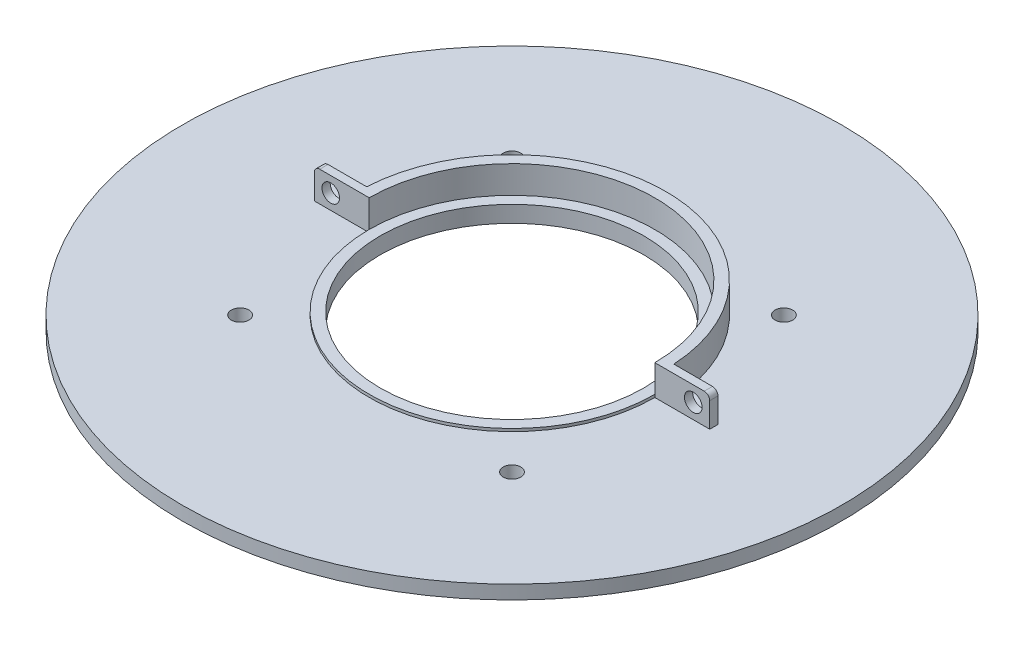
ISO-10303-21;
HEADER;
FILE_DESCRIPTION(('STEP AP214'),'2;1');
FILE_NAME('part.step','',(''),(''),'','','');
FILE_SCHEMA(('AUTOMOTIVE_DESIGN { 1 0 10303 214 1 1 1 1 }'));
ENDSEC;
DATA;
#1=APPLICATION_CONTEXT('core data for automotive mechanical design processes');
#2=APPLICATION_PROTOCOL_DEFINITION('international standard','automotive_design',2000,#1);
#3=PRODUCT_CONTEXT('',#1,'mechanical');
#4=PRODUCT('Part','Part','',(#3));
#5=PRODUCT_RELATED_PRODUCT_CATEGORY('part','',(#4));
#6=PRODUCT_DEFINITION_FORMATION('','',#4);
#7=PRODUCT_DEFINITION_CONTEXT('part definition',#1,'design');
#8=PRODUCT_DEFINITION('design','',#6,#7);
#9=PRODUCT_DEFINITION_SHAPE('','',#8);
#10=(LENGTH_UNIT() NAMED_UNIT(*) SI_UNIT(.MILLI.,.METRE.));
#11=(NAMED_UNIT(*) PLANE_ANGLE_UNIT() SI_UNIT($,.RADIAN.));
#12=(NAMED_UNIT(*) SI_UNIT($,.STERADIAN.) SOLID_ANGLE_UNIT());
#13=UNCERTAINTY_MEASURE_WITH_UNIT(LENGTH_MEASURE(1.E-05),#10,'distance_accuracy_value','');
#14=(GEOMETRIC_REPRESENTATION_CONTEXT(3) GLOBAL_UNCERTAINTY_ASSIGNED_CONTEXT((#13)) GLOBAL_UNIT_ASSIGNED_CONTEXT((#10,
#11,#12)) REPRESENTATION_CONTEXT('',''));
#15=CARTESIAN_POINT('',(0.,0.,0.));
#16=DIRECTION('',(0.,0.,1.));
#17=DIRECTION('',(1.,0.,0.));
#18=AXIS2_PLACEMENT_3D('',#15,#16,#17);
#19=CARTESIAN_POINT('',(0.,3.,0.));
#20=DIRECTION('',(0.,1.,0.));
#21=DIRECTION('',(0.,0.,1.));
#22=AXIS2_PLACEMENT_3D('',#19,#20,#21);
#23=CYLINDRICAL_SURFACE('',#22,28.);
#24=CARTESIAN_POINT('',(0.,4.5,0.));
#25=DIRECTION('',(0.,-1.,0.));
#26=DIRECTION('',(0.,0.,-1.));
#27=AXIS2_PLACEMENT_3D('',#24,#25,#26);
#28=CIRCLE('',#27,28.);
#29=CARTESIAN_POINT('',(27.9597925600316,4.5,-1.5));
#30=VERTEX_POINT('',#29);
#31=CARTESIAN_POINT('',(-27.9597925600316,4.5,-1.5));
#32=VERTEX_POINT('',#31);
#33=EDGE_CURVE('E156',#30,#32,#28,.F.);
#34=ORIENTED_EDGE('',*,*,#33,.T.);
#35=DIRECTION('',(0.,1.,0.));
#36=VECTOR('',#35,1.);
#37=CARTESIAN_POINT('',(-27.9597925600316,4.00000000000001,-1.5));
#38=LINE('',#37,#36);
#39=CARTESIAN_POINT('',(-27.9597925600316,10.,-1.5));
#40=VERTEX_POINT('',#39);
#41=EDGE_CURVE('E200',#32,#40,#38,.T.);
#42=ORIENTED_EDGE('',*,*,#41,.T.);
#43=CARTESIAN_POINT('',(0.,10.,0.));
#44=DIRECTION('',(0.,1.,0.));
#45=DIRECTION('',(0.,0.,1.));
#46=AXIS2_PLACEMENT_3D('',#43,#44,#45);
#47=CIRCLE('',#46,28.);
#48=CARTESIAN_POINT('',(27.9597925600316,10.,-1.5));
#49=VERTEX_POINT('',#48);
#50=EDGE_CURVE('E184',#49,#40,#47,.T.);
#51=ORIENTED_EDGE('',*,*,#50,.F.);
#52=DIRECTION('',(0.,1.,0.));
#53=VECTOR('',#52,1.);
#54=CARTESIAN_POINT('',(27.9597925600316,4.00000000000001,-1.5));
#55=LINE('',#54,#53);
#56=EDGE_CURVE('E203',#30,#49,#55,.T.);
#57=ORIENTED_EDGE('',*,*,#56,.F.);
#58=EDGE_LOOP('',(#34,#42,#51,#57));
#59=FACE_BOUND('',#58,.T.);
#60=ADVANCED_FACE('F61',(#59),#23,.T.);
#61=CARTESIAN_POINT('',(-39.5,5.,-29.6));
#62=DIRECTION('',(0.,1.,0.));
#63=DIRECTION('',(0.,0.,1.));
#64=AXIS2_PLACEMENT_3D('',#61,#62,#63);
#65=PLANE('',#64);
#66=CARTESIAN_POINT('',(0.,5.,0.));
#67=DIRECTION('',(0.,1.,0.));
#68=DIRECTION('',(0.,0.,1.));
#69=AXIS2_PLACEMENT_3D('',#66,#67,#68);
#70=CIRCLE('',#69,24.);
#71=CARTESIAN_POINT('',(0.,5.,24.));
#72=VERTEX_POINT('',#71);
#73=EDGE_CURVE('E242',#72,#72,#70,.T.);
#74=ORIENTED_EDGE('',*,*,#73,.F.);
#75=EDGE_LOOP('',(#74));
#76=FACE_BOUND('',#75,.T.);
#77=CARTESIAN_POINT('',(0.,5.,0.));
#78=DIRECTION('',(0.,-1.,0.));
#79=DIRECTION('',(0.,0.,1.));
#80=AXIS2_PLACEMENT_3D('',#77,#78,#79);
#81=CIRCLE('',#80,26.);
#82=CARTESIAN_POINT('',(26.,5.,0.));
#83=VERTEX_POINT('',#82);
#84=CARTESIAN_POINT('',(-26.,5.,0.));
#85=VERTEX_POINT('',#84);
#86=EDGE_CURVE('E170',#83,#85,#81,.T.);
#87=ORIENTED_EDGE('',*,*,#86,.F.);
#88=CARTESIAN_POINT('',(0.,5.,0.));
#89=DIRECTION('',(0.,1.,0.));
#90=DIRECTION('',(0.,0.,1.));
#91=AXIS2_PLACEMENT_3D('',#88,#89,#90);
#92=CIRCLE('',#91,26.);
#93=EDGE_CURVE('E222',#83,#85,#92,.T.);
#94=ORIENTED_EDGE('',*,*,#93,.T.);
#95=EDGE_LOOP('',(#87,#94));
#96=FACE_BOUND('',#95,.T.);
#97=ADVANCED_FACE('F308',(#76,#96),#65,.T.);
#98=CARTESIAN_POINT('',(0.,4.5,0.));
#99=DIRECTION('',(0.,-1.,0.));
#100=DIRECTION('',(0.,0.,-1.));
#101=AXIS2_PLACEMENT_3D('',#98,#99,#100);
#102=PLANE('',#101);
#103=CARTESIAN_POINT('',(24.7487373415292,4.5,24.7487373415292));
#104=DIRECTION('',(0.,-1.,0.));
#105=DIRECTION('',(0.,0.,-1.));
#106=AXIS2_PLACEMENT_3D('',#103,#104,#105);
#107=CIRCLE('',#106,1.6);
#108=CARTESIAN_POINT('',(24.7487373415292,4.5,23.1487373415292));
#109=VERTEX_POINT('',#108);
#110=EDGE_CURVE('E65',#109,#109,#107,.T.);
#111=ORIENTED_EDGE('',*,*,#110,.T.);
#112=EDGE_LOOP('',(#111));
#113=FACE_BOUND('',#112,.T.);
#114=CARTESIAN_POINT('',(24.7487373415292,4.5,-24.7487373415292));
#115=DIRECTION('',(0.,-1.,0.));
#116=DIRECTION('',(0.,0.,-1.));
#117=AXIS2_PLACEMENT_3D('',#114,#115,#116);
#118=CIRCLE('',#117,1.6);
#119=CARTESIAN_POINT('',(24.7487373415292,4.5,-26.3487373415292));
#120=VERTEX_POINT('',#119);
#121=EDGE_CURVE('E245',#120,#120,#118,.T.);
#122=ORIENTED_EDGE('',*,*,#121,.T.);
#123=EDGE_LOOP('',(#122));
#124=FACE_BOUND('',#123,.T.);
#125=CARTESIAN_POINT('',(-24.7487373415292,4.5,-24.7487373415292));
#126=DIRECTION('',(0.,-1.,0.));
#127=DIRECTION('',(0.,0.,-1.));
#128=AXIS2_PLACEMENT_3D('',#125,#126,#127);
#129=CIRCLE('',#128,1.6);
#130=CARTESIAN_POINT('',(-24.7487373415292,4.5,-26.3487373415292));
#131=VERTEX_POINT('',#130);
#132=EDGE_CURVE('E243',#131,#131,#129,.T.);
#133=ORIENTED_EDGE('',*,*,#132,.T.);
#134=EDGE_LOOP('',(#133));
#135=FACE_BOUND('',#134,.T.);
#136=CARTESIAN_POINT('',(-24.7487373415292,4.5,24.7487373415292));
#137=DIRECTION('',(0.,-1.,0.));
#138=DIRECTION('',(0.,0.,-1.));
#139=AXIS2_PLACEMENT_3D('',#136,#137,#138);
#140=CIRCLE('',#139,1.6);
#141=CARTESIAN_POINT('',(-24.7487373415292,4.5,23.1487373415292));
#142=VERTEX_POINT('',#141);
#143=EDGE_CURVE('E239',#142,#142,#140,.T.);
#144=ORIENTED_EDGE('',*,*,#143,.T.);
#145=EDGE_LOOP('',(#144));
#146=FACE_BOUND('',#145,.T.);
#147=DIRECTION('',(-1.,0.,0.));
#148=VECTOR('',#147,1.);
#149=CARTESIAN_POINT('',(0.,4.5,0.));
#150=LINE('',#149,#148);
#151=CARTESIAN_POINT('',(36.,4.5,0.));
#152=VERTEX_POINT('',#151);
#153=CARTESIAN_POINT('',(26.,4.5,0.));
#154=VERTEX_POINT('',#153);
#155=EDGE_CURVE('E146',#152,#154,#150,.T.);
#156=ORIENTED_EDGE('',*,*,#155,.T.);
#157=CARTESIAN_POINT('',(0.,4.5,0.));
#158=DIRECTION('',(0.,-1.,0.));
#159=DIRECTION('',(0.,0.,-1.));
#160=AXIS2_PLACEMENT_3D('',#157,#158,#159);
#161=CIRCLE('',#160,26.);
#162=CARTESIAN_POINT('',(-26.,4.5,0.));
#163=VERTEX_POINT('',#162);
#164=EDGE_CURVE('E151',#154,#163,#161,.T.);
#165=ORIENTED_EDGE('',*,*,#164,.T.);
#166=DIRECTION('',(-1.,0.,0.));
#167=VECTOR('',#166,1.);
#168=CARTESIAN_POINT('',(0.,4.5,0.));
#169=LINE('',#168,#167);
#170=CARTESIAN_POINT('',(-36.,4.5,0.));
#171=VERTEX_POINT('',#170);
#172=EDGE_CURVE('E220',#163,#171,#169,.T.);
#173=ORIENTED_EDGE('',*,*,#172,.T.);
#174=DIRECTION('',(0.,0.,1.));
#175=VECTOR('',#174,1.);
#176=CARTESIAN_POINT('',(-36.,4.5,0.));
#177=LINE('',#176,#175);
#178=CARTESIAN_POINT('',(-36.,4.5,-1.5));
#179=VERTEX_POINT('',#178);
#180=EDGE_CURVE('E218',#179,#171,#177,.T.);
#181=ORIENTED_EDGE('',*,*,#180,.F.);
#182=DIRECTION('',(-1.,0.,0.));
#183=VECTOR('',#182,1.);
#184=CARTESIAN_POINT('',(0.,4.5,-1.5));
#185=LINE('',#184,#183);
#186=EDGE_CURVE('E216',#32,#179,#185,.T.);
#187=ORIENTED_EDGE('',*,*,#186,.F.);
#188=ORIENTED_EDGE('',*,*,#33,.F.);
#189=DIRECTION('',(1.,0.,0.));
#190=VECTOR('',#189,1.);
#191=CARTESIAN_POINT('',(0.,4.5,-1.5));
#192=LINE('',#191,#190);
#193=CARTESIAN_POINT('',(36.,4.5,-1.5));
#194=VERTEX_POINT('',#193);
#195=EDGE_CURVE('E214',#30,#194,#192,.T.);
#196=ORIENTED_EDGE('',*,*,#195,.T.);
#197=DIRECTION('',(0.,0.,1.));
#198=VECTOR('',#197,1.);
#199=CARTESIAN_POINT('',(36.,4.5,0.));
#200=LINE('',#199,#198);
#201=EDGE_CURVE('E153',#194,#152,#200,.T.);
#202=ORIENTED_EDGE('',*,*,#201,.T.);
#203=EDGE_LOOP('',(#156,#165,#173,#181,#187,#188,#196,#202));
#204=FACE_BOUND('',#203,.T.);
#205=CARTESIAN_POINT('',(0.,4.5,0.));
#206=DIRECTION('',(0.,-1.,0.));
#207=DIRECTION('',(0.,0.,-1.));
#208=AXIS2_PLACEMENT_3D('',#205,#206,#207);
#209=CIRCLE('',#208,60.);
#210=CARTESIAN_POINT('',(0.,4.50000000000003,-60.));
#211=VERTEX_POINT('',#210);
#212=EDGE_CURVE('E513',#211,#211,#209,.F.);
#213=ORIENTED_EDGE('',*,*,#212,.T.);
#214=EDGE_LOOP('',(#213));
#215=FACE_BOUND('',#214,.T.);
#216=ADVANCED_FACE('F148',(#113,#124,#135,#146,#204,#215),#102,.F.);
#217=CARTESIAN_POINT('',(-36.,4.00000000000001,0.));
#218=DIRECTION('',(1.,0.,0.));
#219=DIRECTION('',(0.,0.,-1.));
#220=AXIS2_PLACEMENT_3D('',#217,#218,#219);
#221=PLANE('',#220);
#222=DIRECTION('',(0.,1.,0.));
#223=VECTOR('',#222,1.);
#224=CARTESIAN_POINT('',(-36.,4.00000000000001,0.));
#225=LINE('',#224,#223);
#226=CARTESIAN_POINT('',(-36.,9.,0.));
#227=VERTEX_POINT('',#226);
#228=EDGE_CURVE('E194',#171,#227,#225,.T.);
#229=ORIENTED_EDGE('',*,*,#228,.T.);
#230=DIRECTION('',(0.,0.,-1.));
#231=VECTOR('',#230,1.);
#232=CARTESIAN_POINT('',(-36.,9.,-1.5));
#233=LINE('',#232,#231);
#234=CARTESIAN_POINT('',(-36.,9.,-1.5));
#235=VERTEX_POINT('',#234);
#236=EDGE_CURVE('E225',#227,#235,#233,.T.);
#237=ORIENTED_EDGE('',*,*,#236,.T.);
#238=DIRECTION('',(0.,1.,0.));
#239=VECTOR('',#238,1.);
#240=CARTESIAN_POINT('',(-36.,4.00000000000001,-1.5));
#241=LINE('',#240,#239);
#242=EDGE_CURVE('E197',#179,#235,#241,.T.);
#243=ORIENTED_EDGE('',*,*,#242,.F.);
#244=ORIENTED_EDGE('',*,*,#180,.T.);
#245=EDGE_LOOP('',(#229,#237,#243,#244));
#246=FACE_BOUND('',#245,.T.);
#247=ADVANCED_FACE('F333',(#246),#221,.F.);
#248=CARTESIAN_POINT('',(0.,4.00000000000001,-1.5));
#249=DIRECTION('',(0.,0.,1.));
#250=DIRECTION('',(1.,0.,0.));
#251=AXIS2_PLACEMENT_3D('',#248,#249,#250);
#252=PLANE('',#251);
#253=CARTESIAN_POINT('',(-33.,7.25,-1.5));
#254=DIRECTION('',(0.,0.,1.));
#255=DIRECTION('',(1.,0.,0.));
#256=AXIS2_PLACEMENT_3D('',#253,#254,#255);
#257=CIRCLE('',#256,1.6);
#258=CARTESIAN_POINT('',(-31.4,7.25,-1.5));
#259=VERTEX_POINT('',#258);
#260=EDGE_CURVE('E172',#259,#259,#257,.T.);
#261=ORIENTED_EDGE('',*,*,#260,.T.);
#262=EDGE_LOOP('',(#261));
#263=FACE_BOUND('',#262,.T.);
#264=ORIENTED_EDGE('',*,*,#242,.T.);
#265=CARTESIAN_POINT('',(-35.,9.,-1.5));
#266=DIRECTION('',(0.,0.,1.));
#267=DIRECTION('',(1.,0.,0.));
#268=AXIS2_PLACEMENT_3D('',#265,#266,#267);
#269=CIRCLE('',#268,1.);
#270=CARTESIAN_POINT('',(-35.,10.,-1.5));
#271=VERTEX_POINT('',#270);
#272=EDGE_CURVE('E228',#235,#271,#269,.F.);
#273=ORIENTED_EDGE('',*,*,#272,.T.);
#274=DIRECTION('',(1.,0.,0.));
#275=VECTOR('',#274,1.);
#276=CARTESIAN_POINT('',(0.,10.,-1.5));
#277=LINE('',#276,#275);
#278=EDGE_CURVE('E187',#271,#40,#277,.T.);
#279=ORIENTED_EDGE('',*,*,#278,.T.);
#280=ORIENTED_EDGE('',*,*,#41,.F.);
#281=ORIENTED_EDGE('',*,*,#186,.T.);
#282=EDGE_LOOP('',(#264,#273,#279,#280,#281));
#283=FACE_BOUND('',#282,.T.);
#284=ADVANCED_FACE('F290',(#263,#283),#252,.F.);
#285=CARTESIAN_POINT('',(0.,4.00000000000001,-1.5));
#286=DIRECTION('',(0.,0.,-1.));
#287=DIRECTION('',(-1.,0.,0.));
#288=AXIS2_PLACEMENT_3D('',#285,#286,#287);
#289=PLANE('',#288);
#290=CARTESIAN_POINT('',(33.,7.25,-1.5));
#291=DIRECTION('',(0.,0.,-1.));
#292=DIRECTION('',(-1.,0.,0.));
#293=AXIS2_PLACEMENT_3D('',#290,#291,#292);
#294=CIRCLE('',#293,1.6);
#295=CARTESIAN_POINT('',(31.4,7.25,-1.5));
#296=VERTEX_POINT('',#295);
#297=EDGE_CURVE('E281',#296,#296,#294,.T.);
#298=ORIENTED_EDGE('',*,*,#297,.F.);
#299=EDGE_LOOP('',(#298));
#300=FACE_BOUND('',#299,.T.);
#301=DIRECTION('',(-1.,0.,0.));
#302=VECTOR('',#301,1.);
#303=CARTESIAN_POINT('',(0.,10.,-1.5));
#304=LINE('',#303,#302);
#305=CARTESIAN_POINT('',(35.,10.,-1.5));
#306=VERTEX_POINT('',#305);
#307=EDGE_CURVE('E182',#306,#49,#304,.T.);
#308=ORIENTED_EDGE('',*,*,#307,.F.);
#309=CARTESIAN_POINT('',(35.,9.,-1.5));
#310=DIRECTION('',(0.,0.,-1.));
#311=DIRECTION('',(-1.,0.,0.));
#312=AXIS2_PLACEMENT_3D('',#309,#310,#311);
#313=CIRCLE('',#312,1.);
#314=CARTESIAN_POINT('',(36.,9.,-1.5));
#315=VERTEX_POINT('',#314);
#316=EDGE_CURVE('E85',#306,#315,#313,.T.);
#317=ORIENTED_EDGE('',*,*,#316,.T.);
#318=DIRECTION('',(0.,1.,0.));
#319=VECTOR('',#318,1.);
#320=CARTESIAN_POINT('',(36.,4.00000000000001,-1.5));
#321=LINE('',#320,#319);
#322=EDGE_CURVE('E206',#194,#315,#321,.T.);
#323=ORIENTED_EDGE('',*,*,#322,.F.);
#324=ORIENTED_EDGE('',*,*,#195,.F.);
#325=ORIENTED_EDGE('',*,*,#56,.T.);
#326=EDGE_LOOP('',(#308,#317,#323,#324,#325));
#327=FACE_BOUND('',#326,.T.);
#328=ADVANCED_FACE('F349',(#300,#327),#289,.T.);
#329=CARTESIAN_POINT('',(36.,4.00000000000001,0.));
#330=DIRECTION('',(1.,0.,0.));
#331=DIRECTION('',(0.,0.,-1.));
#332=AXIS2_PLACEMENT_3D('',#329,#330,#331);
#333=PLANE('',#332);
#334=ORIENTED_EDGE('',*,*,#322,.T.);
#335=DIRECTION('',(0.,0.,-1.));
#336=VECTOR('',#335,1.);
#337=CARTESIAN_POINT('',(36.,9.,0.));
#338=LINE('',#337,#336);
#339=CARTESIAN_POINT('',(36.,9.,0.));
#340=VERTEX_POINT('',#339);
#341=EDGE_CURVE('E70',#315,#340,#338,.F.);
#342=ORIENTED_EDGE('',*,*,#341,.T.);
#343=DIRECTION('',(0.,1.,0.));
#344=VECTOR('',#343,1.);
#345=CARTESIAN_POINT('',(36.,4.00000000000001,0.));
#346=LINE('',#345,#344);
#347=EDGE_CURVE('E208',#152,#340,#346,.T.);
#348=ORIENTED_EDGE('',*,*,#347,.F.);
#349=ORIENTED_EDGE('',*,*,#201,.F.);
#350=EDGE_LOOP('',(#334,#342,#348,#349));
#351=FACE_BOUND('',#350,.T.);
#352=ADVANCED_FACE('F350',(#351),#333,.T.);
#353=CARTESIAN_POINT('',(0.,4.00000000000001,0.));
#354=DIRECTION('',(0.,1.,0.));
#355=DIRECTION('',(0.,0.,1.));
#356=AXIS2_PLACEMENT_3D('',#353,#354,#355);
#357=CYLINDRICAL_SURFACE('',#356,26.);
#358=ORIENTED_EDGE('',*,*,#93,.F.);
#359=DIRECTION('',(0.,1.,0.));
#360=VECTOR('',#359,1.);
#361=CARTESIAN_POINT('',(26.,4.00000000000001,0.));
#362=LINE('',#361,#360);
#363=CARTESIAN_POINT('',(26.,10.,0.));
#364=VERTEX_POINT('',#363);
#365=EDGE_CURVE('E169',#83,#364,#362,.T.);
#366=ORIENTED_EDGE('',*,*,#365,.T.);
#367=CARTESIAN_POINT('',(0.,10.,0.));
#368=DIRECTION('',(0.,1.,0.));
#369=DIRECTION('',(0.,0.,1.));
#370=AXIS2_PLACEMENT_3D('',#367,#368,#369);
#371=CIRCLE('',#370,26.);
#372=CARTESIAN_POINT('',(-26.,10.,0.));
#373=VERTEX_POINT('',#372);
#374=EDGE_CURVE('E176',#364,#373,#371,.T.);
#375=ORIENTED_EDGE('',*,*,#374,.T.);
#376=DIRECTION('',(0.,1.,0.));
#377=VECTOR('',#376,1.);
#378=CARTESIAN_POINT('',(-26.,4.00000000000001,0.));
#379=LINE('',#378,#377);
#380=EDGE_CURVE('E191',#85,#373,#379,.T.);
#381=ORIENTED_EDGE('',*,*,#380,.F.);
#382=EDGE_LOOP('',(#358,#366,#375,#381));
#383=FACE_BOUND('',#382,.T.);
#384=ADVANCED_FACE('F342',(#383),#357,.F.);
#385=CARTESIAN_POINT('',(0.,4.00000000000001,0.));
#386=DIRECTION('',(0.,0.,1.));
#387=DIRECTION('',(1.,0.,0.));
#388=AXIS2_PLACEMENT_3D('',#385,#386,#387);
#389=PLANE('',#388);
#390=CARTESIAN_POINT('',(-33.,7.25,0.));
#391=DIRECTION('',(0.,0.,1.));
#392=DIRECTION('',(1.,0.,0.));
#393=AXIS2_PLACEMENT_3D('',#390,#391,#392);
#394=CIRCLE('',#393,1.6);
#395=CARTESIAN_POINT('',(-31.4,7.25,0.));
#396=VERTEX_POINT('',#395);
#397=EDGE_CURVE('E284',#396,#396,#394,.T.);
#398=ORIENTED_EDGE('',*,*,#397,.F.);
#399=EDGE_LOOP('',(#398));
#400=FACE_BOUND('',#399,.T.);
#401=DIRECTION('',(1.,0.,0.));
#402=VECTOR('',#401,1.);
#403=CARTESIAN_POINT('',(0.,10.,0.));
#404=LINE('',#403,#402);
#405=CARTESIAN_POINT('',(-35.,10.,0.));
#406=VERTEX_POINT('',#405);
#407=EDGE_CURVE('E189',#406,#373,#404,.T.);
#408=ORIENTED_EDGE('',*,*,#407,.F.);
#409=CARTESIAN_POINT('',(-35.,9.,0.));
#410=DIRECTION('',(0.,0.,1.));
#411=DIRECTION('',(1.,0.,0.));
#412=AXIS2_PLACEMENT_3D('',#409,#410,#411);
#413=CIRCLE('',#412,1.);
#414=EDGE_CURVE('E235',#406,#227,#413,.T.);
#415=ORIENTED_EDGE('',*,*,#414,.T.);
#416=ORIENTED_EDGE('',*,*,#228,.F.);
#417=ORIENTED_EDGE('',*,*,#172,.F.);
#418=DIRECTION('',(0.,1.,0.));
#419=VECTOR('',#418,1.);
#420=CARTESIAN_POINT('',(-26.,-58.1099033699941,0.));
#421=LINE('',#420,#419);
#422=EDGE_CURVE('E164',#163,#85,#421,.T.);
#423=ORIENTED_EDGE('',*,*,#422,.T.);
#424=ORIENTED_EDGE('',*,*,#380,.T.);
#425=EDGE_LOOP('',(#408,#415,#416,#417,#423,#424));
#426=FACE_BOUND('',#425,.T.);
#427=ADVANCED_FACE('F331',(#400,#426),#389,.T.);
#428=CARTESIAN_POINT('',(0.,4.00000000000001,0.));
#429=DIRECTION('',(0.,0.,1.));
#430=DIRECTION('',(1.,0.,0.));
#431=AXIS2_PLACEMENT_3D('',#428,#429,#430);
#432=PLANE('',#431);
#433=CARTESIAN_POINT('',(33.,7.25,0.));
#434=DIRECTION('',(0.,0.,1.));
#435=DIRECTION('',(1.,0.,0.));
#436=AXIS2_PLACEMENT_3D('',#433,#434,#435);
#437=CIRCLE('',#436,1.6);
#438=CARTESIAN_POINT('',(34.6,7.25,0.));
#439=VERTEX_POINT('',#438);
#440=EDGE_CURVE('E278',#439,#439,#437,.T.);
#441=ORIENTED_EDGE('',*,*,#440,.F.);
#442=EDGE_LOOP('',(#441));
#443=FACE_BOUND('',#442,.T.);
#444=ORIENTED_EDGE('',*,*,#347,.T.);
#445=CARTESIAN_POINT('',(35.,9.,0.));
#446=DIRECTION('',(0.,0.,1.));
#447=DIRECTION('',(1.,0.,0.));
#448=AXIS2_PLACEMENT_3D('',#445,#446,#447);
#449=CIRCLE('',#448,1.);
#450=CARTESIAN_POINT('',(35.,10.,0.));
#451=VERTEX_POINT('',#450);
#452=EDGE_CURVE('E12',#340,#451,#449,.T.);
#453=ORIENTED_EDGE('',*,*,#452,.T.);
#454=DIRECTION('',(1.,0.,0.));
#455=VECTOR('',#454,1.);
#456=CARTESIAN_POINT('',(0.,10.,0.));
#457=LINE('',#456,#455);
#458=EDGE_CURVE('E179',#364,#451,#457,.T.);
#459=ORIENTED_EDGE('',*,*,#458,.F.);
#460=ORIENTED_EDGE('',*,*,#365,.F.);
#461=DIRECTION('',(0.,1.,0.));
#462=VECTOR('',#461,1.);
#463=CARTESIAN_POINT('',(26.,-58.1099033699941,0.));
#464=LINE('',#463,#462);
#465=EDGE_CURVE('E162',#154,#83,#464,.T.);
#466=ORIENTED_EDGE('',*,*,#465,.F.);
#467=ORIENTED_EDGE('',*,*,#155,.F.);
#468=EDGE_LOOP('',(#444,#453,#459,#460,#466,#467));
#469=FACE_BOUND('',#468,.T.);
#470=ADVANCED_FACE('F167',(#443,#469),#432,.T.);
#471=CARTESIAN_POINT('',(0.,10.,0.));
#472=DIRECTION('',(0.,1.,0.));
#473=DIRECTION('',(0.,0.,1.));
#474=AXIS2_PLACEMENT_3D('',#471,#472,#473);
#475=PLANE('',#474);
#476=ORIENTED_EDGE('',*,*,#278,.F.);
#477=DIRECTION('',(0.,0.,-1.));
#478=VECTOR('',#477,1.);
#479=CARTESIAN_POINT('',(-35.,10.,0.));
#480=LINE('',#479,#478);
#481=EDGE_CURVE('E233',#271,#406,#480,.F.);
#482=ORIENTED_EDGE('',*,*,#481,.T.);
#483=ORIENTED_EDGE('',*,*,#407,.T.);
#484=ORIENTED_EDGE('',*,*,#374,.F.);
#485=ORIENTED_EDGE('',*,*,#458,.T.);
#486=DIRECTION('',(0.,0.,-1.));
#487=VECTOR('',#486,1.);
#488=CARTESIAN_POINT('',(35.,10.,0.));
#489=LINE('',#488,#487);
#490=EDGE_CURVE('E230',#451,#306,#489,.T.);
#491=ORIENTED_EDGE('',*,*,#490,.T.);
#492=ORIENTED_EDGE('',*,*,#307,.T.);
#493=ORIENTED_EDGE('',*,*,#50,.T.);
#494=EDGE_LOOP('',(#476,#482,#483,#484,#485,#491,#492,#493));
#495=FACE_BOUND('',#494,.T.);
#496=ADVANCED_FACE('F305',(#495),#475,.T.);
#497=CARTESIAN_POINT('',(0.,-58.1099033699941,0.));
#498=DIRECTION('',(0.,1.,0.));
#499=DIRECTION('',(0.,0.,1.));
#500=AXIS2_PLACEMENT_3D('',#497,#498,#499);
#501=CYLINDRICAL_SURFACE('',#500,26.);
#502=ORIENTED_EDGE('',*,*,#465,.T.);
#503=ORIENTED_EDGE('',*,*,#86,.T.);
#504=ORIENTED_EDGE('',*,*,#422,.F.);
#505=ORIENTED_EDGE('',*,*,#164,.F.);
#506=EDGE_LOOP('',(#502,#503,#504,#505));
#507=FACE_BOUND('',#506,.T.);
#508=ADVANCED_FACE('F160',(#507),#501,.T.);
#509=CARTESIAN_POINT('',(-33.,7.25,-4.));
#510=DIRECTION('',(0.,0.,1.));
#511=DIRECTION('',(1.,0.,0.));
#512=AXIS2_PLACEMENT_3D('',#509,#510,#511);
#513=CYLINDRICAL_SURFACE('',#512,1.6);
#514=ORIENTED_EDGE('',*,*,#397,.T.);
#515=EDGE_LOOP('',(#514));
#516=FACE_BOUND('',#515,.T.);
#517=ORIENTED_EDGE('',*,*,#260,.F.);
#518=EDGE_LOOP('',(#517));
#519=FACE_BOUND('',#518,.T.);
#520=ADVANCED_FACE('F293',(#516,#519),#513,.F.);
#521=CARTESIAN_POINT('',(33.,7.25,-4.));
#522=DIRECTION('',(0.,0.,1.));
#523=DIRECTION('',(1.,0.,0.));
#524=AXIS2_PLACEMENT_3D('',#521,#522,#523);
#525=CYLINDRICAL_SURFACE('',#524,1.6);
#526=ORIENTED_EDGE('',*,*,#297,.T.);
#527=EDGE_LOOP('',(#526));
#528=FACE_BOUND('',#527,.T.);
#529=ORIENTED_EDGE('',*,*,#440,.T.);
#530=EDGE_LOOP('',(#529));
#531=FACE_BOUND('',#530,.T.);
#532=ADVANCED_FACE('F295',(#528,#531),#525,.F.);
#533=CARTESIAN_POINT('',(-35.,9.,0.));
#534=DIRECTION('',(0.,0.,1.));
#535=DIRECTION('',(1.,0.,0.));
#536=AXIS2_PLACEMENT_3D('',#533,#534,#535);
#537=CYLINDRICAL_SURFACE('',#536,1.);
#538=ORIENTED_EDGE('',*,*,#414,.F.);
#539=ORIENTED_EDGE('',*,*,#481,.F.);
#540=ORIENTED_EDGE('',*,*,#272,.F.);
#541=ORIENTED_EDGE('',*,*,#236,.F.);
#542=EDGE_LOOP('',(#538,#539,#540,#541));
#543=FACE_BOUND('',#542,.T.);
#544=ADVANCED_FACE('F302',(#543),#537,.T.);
#545=CARTESIAN_POINT('',(35.,9.,0.));
#546=DIRECTION('',(0.,0.,-1.));
#547=DIRECTION('',(-1.,0.,0.));
#548=AXIS2_PLACEMENT_3D('',#545,#546,#547);
#549=CYLINDRICAL_SURFACE('',#548,1.);
#550=ORIENTED_EDGE('',*,*,#452,.F.);
#551=ORIENTED_EDGE('',*,*,#341,.F.);
#552=ORIENTED_EDGE('',*,*,#316,.F.);
#553=ORIENTED_EDGE('',*,*,#490,.F.);
#554=EDGE_LOOP('',(#550,#551,#552,#553));
#555=FACE_BOUND('',#554,.T.);
#556=ADVANCED_FACE('F63',(#555),#549,.T.);
#557=CARTESIAN_POINT('',(0.,13.,0.));
#558=DIRECTION('',(0.,-1.,0.));
#559=DIRECTION('',(0.,0.,-1.));
#560=AXIS2_PLACEMENT_3D('',#557,#558,#559);
#561=CYLINDRICAL_SURFACE('',#560,24.);
#562=ORIENTED_EDGE('',*,*,#73,.T.);
#563=EDGE_LOOP('',(#562));
#564=FACE_BOUND('',#563,.T.);
#565=CARTESIAN_POINT('',(0.,2.,0.));
#566=DIRECTION('',(0.,-1.,0.));
#567=DIRECTION('',(0.,0.,-1.));
#568=AXIS2_PLACEMENT_3D('',#565,#566,#567);
#569=CIRCLE('',#568,24.);
#570=CARTESIAN_POINT('',(0.,2.,-24.));
#571=VERTEX_POINT('',#570);
#572=EDGE_CURVE('E246',#571,#571,#569,.T.);
#573=ORIENTED_EDGE('',*,*,#572,.T.);
#574=EDGE_LOOP('',(#573));
#575=FACE_BOUND('',#574,.T.);
#576=ADVANCED_FACE('F323',(#564,#575),#561,.F.);
#577=CARTESIAN_POINT('',(-24.7487373415292,13.,24.7487373415292));
#578=DIRECTION('',(0.,-1.,0.));
#579=DIRECTION('',(0.,0.,-1.));
#580=AXIS2_PLACEMENT_3D('',#577,#578,#579);
#581=CYLINDRICAL_SURFACE('',#580,1.6);
#582=ORIENTED_EDGE('',*,*,#143,.F.);
#583=EDGE_LOOP('',(#582));
#584=FACE_BOUND('',#583,.T.);
#585=CARTESIAN_POINT('',(-24.7487373415292,2.,24.7487373415292));
#586=DIRECTION('',(0.,-1.,0.));
#587=DIRECTION('',(0.,0.,-1.));
#588=AXIS2_PLACEMENT_3D('',#585,#586,#587);
#589=CIRCLE('',#588,1.6);
#590=CARTESIAN_POINT('',(-24.7487373415292,2.,23.1487373415292));
#591=VERTEX_POINT('',#590);
#592=EDGE_CURVE('E264',#591,#591,#589,.T.);
#593=ORIENTED_EDGE('',*,*,#592,.T.);
#594=EDGE_LOOP('',(#593));
#595=FACE_BOUND('',#594,.T.);
#596=ADVANCED_FACE('F441',(#584,#595),#581,.F.);
#597=CARTESIAN_POINT('',(-24.7487373415292,13.,-24.7487373415292));
#598=DIRECTION('',(0.,-1.,0.));
#599=DIRECTION('',(0.,0.,-1.));
#600=AXIS2_PLACEMENT_3D('',#597,#598,#599);
#601=CYLINDRICAL_SURFACE('',#600,1.6);
#602=ORIENTED_EDGE('',*,*,#132,.F.);
#603=EDGE_LOOP('',(#602));
#604=FACE_BOUND('',#603,.T.);
#605=CARTESIAN_POINT('',(-24.7487373415292,2.,-24.7487373415292));
#606=DIRECTION('',(0.,-1.,0.));
#607=DIRECTION('',(0.,0.,-1.));
#608=AXIS2_PLACEMENT_3D('',#605,#606,#607);
#609=CIRCLE('',#608,1.6);
#610=CARTESIAN_POINT('',(-24.7487373415292,2.,-26.3487373415292));
#611=VERTEX_POINT('',#610);
#612=EDGE_CURVE('E270',#611,#611,#609,.T.);
#613=ORIENTED_EDGE('',*,*,#612,.T.);
#614=EDGE_LOOP('',(#613));
#615=FACE_BOUND('',#614,.T.);
#616=ADVANCED_FACE('F452',(#604,#615),#601,.F.);
#617=CARTESIAN_POINT('',(24.7487373415292,13.,-24.7487373415292));
#618=DIRECTION('',(0.,-1.,0.));
#619=DIRECTION('',(0.,0.,-1.));
#620=AXIS2_PLACEMENT_3D('',#617,#618,#619);
#621=CYLINDRICAL_SURFACE('',#620,1.6);
#622=ORIENTED_EDGE('',*,*,#121,.F.);
#623=EDGE_LOOP('',(#622));
#624=FACE_BOUND('',#623,.T.);
#625=CARTESIAN_POINT('',(24.7487373415292,2.,-24.7487373415292));
#626=DIRECTION('',(0.,-1.,0.));
#627=DIRECTION('',(0.,0.,-1.));
#628=AXIS2_PLACEMENT_3D('',#625,#626,#627);
#629=CIRCLE('',#628,1.6);
#630=CARTESIAN_POINT('',(24.7487373415292,2.,-26.3487373415292));
#631=VERTEX_POINT('',#630);
#632=EDGE_CURVE('E265',#631,#631,#629,.T.);
#633=ORIENTED_EDGE('',*,*,#632,.T.);
#634=EDGE_LOOP('',(#633));
#635=FACE_BOUND('',#634,.T.);
#636=ADVANCED_FACE('F258',(#624,#635),#621,.F.);
#637=CARTESIAN_POINT('',(24.7487373415292,13.,24.7487373415292));
#638=DIRECTION('',(0.,-1.,0.));
#639=DIRECTION('',(0.,0.,-1.));
#640=AXIS2_PLACEMENT_3D('',#637,#638,#639);
#641=CYLINDRICAL_SURFACE('',#640,1.6);
#642=ORIENTED_EDGE('',*,*,#110,.F.);
#643=EDGE_LOOP('',(#642));
#644=FACE_BOUND('',#643,.T.);
#645=CARTESIAN_POINT('',(24.7487373415292,2.,24.7487373415292));
#646=DIRECTION('',(0.,-1.,0.));
#647=DIRECTION('',(0.,0.,-1.));
#648=AXIS2_PLACEMENT_3D('',#645,#646,#647);
#649=CIRCLE('',#648,1.6);
#650=CARTESIAN_POINT('',(24.7487373415292,2.,23.1487373415292));
#651=VERTEX_POINT('',#650);
#652=EDGE_CURVE('E262',#651,#651,#649,.T.);
#653=ORIENTED_EDGE('',*,*,#652,.T.);
#654=EDGE_LOOP('',(#653));
#655=FACE_BOUND('',#654,.T.);
#656=ADVANCED_FACE('F254',(#644,#655),#641,.F.);
#657=CARTESIAN_POINT('',(0.,2.,0.));
#658=DIRECTION('',(0.,-1.,0.));
#659=DIRECTION('',(0.,0.,-1.));
#660=AXIS2_PLACEMENT_3D('',#657,#658,#659);
#661=PLANE('',#660);
#662=ORIENTED_EDGE('',*,*,#632,.F.);
#663=EDGE_LOOP('',(#662));
#664=FACE_BOUND('',#663,.T.);
#665=ORIENTED_EDGE('',*,*,#592,.F.);
#666=EDGE_LOOP('',(#665));
#667=FACE_BOUND('',#666,.T.);
#668=ORIENTED_EDGE('',*,*,#572,.F.);
#669=EDGE_LOOP('',(#668));
#670=FACE_BOUND('',#669,.T.);
#671=ORIENTED_EDGE('',*,*,#652,.F.);
#672=EDGE_LOOP('',(#671));
#673=FACE_BOUND('',#672,.T.);
#674=ORIENTED_EDGE('',*,*,#612,.F.);
#675=EDGE_LOOP('',(#674));
#676=FACE_BOUND('',#675,.T.);
#677=CARTESIAN_POINT('',(0.,2.,0.));
#678=DIRECTION('',(0.,-1.,0.));
#679=DIRECTION('',(0.,0.,-1.));
#680=AXIS2_PLACEMENT_3D('',#677,#678,#679);
#681=CIRCLE('',#680,60.);
#682=CARTESIAN_POINT('',(0.,1.99999999999997,-60.));
#683=VERTEX_POINT('',#682);
#684=EDGE_CURVE('E516',#683,#683,#681,.T.);
#685=ORIENTED_EDGE('',*,*,#684,.T.);
#686=EDGE_LOOP('',(#685));
#687=FACE_BOUND('',#686,.T.);
#688=ADVANCED_FACE('F257',(#664,#667,#670,#673,#676,#687),#661,.T.);
#689=CARTESIAN_POINT('',(0.,174.205627484771,0.));
#690=DIRECTION('',(0.,-1.,0.));
#691=DIRECTION('',(0.,0.,-1.));
#692=AXIS2_PLACEMENT_3D('',#689,#690,#691);
#693=CYLINDRICAL_SURFACE('',#692,60.);
#694=CARTESIAN_POINT('',(0.,4.50000000000003,-60.));
#695=CARTESIAN_POINT('',(0.,4.47395833333336,-60.));
#696=CARTESIAN_POINT('',(0.,4.44791666666669,-60.));
#697=CARTESIAN_POINT('',(0.,4.39583333333336,-60.));
#698=CARTESIAN_POINT('',(0.,4.3697916666667,-60.));
#699=CARTESIAN_POINT('',(0.,4.31770833333336,-60.));
#700=CARTESIAN_POINT('',(0.,4.29166666666669,-60.));
#701=CARTESIAN_POINT('',(0.,4.23958333333336,-60.));
#702=CARTESIAN_POINT('',(0.,4.2135416666667,-60.));
#703=CARTESIAN_POINT('',(0.,4.16145833333337,-60.));
#704=CARTESIAN_POINT('',(0.,4.1354166666667,-60.));
#705=CARTESIAN_POINT('',(0.,4.08333333333336,-60.));
#706=CARTESIAN_POINT('',(0.,4.05729166666668,-60.));
#707=CARTESIAN_POINT('',(0.,4.00520833333335,-60.));
#708=CARTESIAN_POINT('',(0.,3.97916666666669,-60.));
#709=CARTESIAN_POINT('',(0.,3.92708333333336,-60.));
#710=CARTESIAN_POINT('',(0.,3.90104166666669,-60.));
#711=CARTESIAN_POINT('',(0.,3.84895833333335,-60.));
#712=CARTESIAN_POINT('',(0.,3.82291666666668,-60.));
#713=CARTESIAN_POINT('',(0.,3.77083333333334,-60.));
#714=CARTESIAN_POINT('',(0.,3.74479166666668,-60.));
#715=CARTESIAN_POINT('',(0.,3.69270833333335,-60.));
#716=CARTESIAN_POINT('',(0.,3.66666666666668,-60.));
#717=CARTESIAN_POINT('',(0.,3.61458333333334,-60.));
#718=CARTESIAN_POINT('',(0.,3.58854166666667,-60.));
#719=CARTESIAN_POINT('',(0.,3.53645833333333,-60.));
#720=CARTESIAN_POINT('',(0.,3.51041666666667,-60.));
#721=CARTESIAN_POINT('',(0.,3.45833333333334,-60.));
#722=CARTESIAN_POINT('',(0.,3.43229166666667,-60.));
#723=CARTESIAN_POINT('',(0.,3.38020833333334,-60.));
#724=CARTESIAN_POINT('',(0.,3.35416666666668,-60.));
#725=CARTESIAN_POINT('',(0.,3.30208333333334,-60.));
#726=CARTESIAN_POINT('',(0.,3.27604166666667,-60.));
#727=CARTESIAN_POINT('',(0.,3.22395833333333,-60.));
#728=CARTESIAN_POINT('',(0.,3.19791666666666,-60.));
#729=CARTESIAN_POINT('',(0.,3.14583333333333,-60.));
#730=CARTESIAN_POINT('',(0.,3.11979166666667,-60.));
#731=CARTESIAN_POINT('',(0.,3.06770833333334,-60.));
#732=CARTESIAN_POINT('',(0.,3.04166666666666,-60.));
#733=CARTESIAN_POINT('',(0.,2.98958333333333,-60.));
#734=CARTESIAN_POINT('',(0.,2.96354166666667,-60.));
#735=CARTESIAN_POINT('',(0.,2.91145833333334,-60.));
#736=CARTESIAN_POINT('',(0.,2.88541666666667,-60.));
#737=CARTESIAN_POINT('',(0.,2.83333333333333,-60.));
#738=CARTESIAN_POINT('',(0.,2.80729166666666,-60.));
#739=CARTESIAN_POINT('',(0.,2.75520833333332,-60.));
#740=CARTESIAN_POINT('',(0.,2.72916666666666,-60.));
#741=CARTESIAN_POINT('',(0.,2.67708333333333,-60.));
#742=CARTESIAN_POINT('',(0.,2.65104166666666,-60.));
#743=CARTESIAN_POINT('',(0.,2.59895833333332,-60.));
#744=CARTESIAN_POINT('',(0.,2.57291666666665,-60.));
#745=CARTESIAN_POINT('',(0.,2.52083333333331,-60.));
#746=CARTESIAN_POINT('',(0.,2.49479166666665,-60.));
#747=CARTESIAN_POINT('',(0.,2.44270833333332,-60.));
#748=CARTESIAN_POINT('',(0.,2.41666666666665,-60.));
#749=CARTESIAN_POINT('',(0.,2.36458333333331,-60.));
#750=CARTESIAN_POINT('',(0.,2.33854166666664,-60.));
#751=CARTESIAN_POINT('',(0.,2.28645833333331,-60.));
#752=CARTESIAN_POINT('',(0.,2.26041666666664,-60.));
#753=CARTESIAN_POINT('',(0.,2.20833333333331,-60.));
#754=CARTESIAN_POINT('',(0.,2.18229166666664,-60.));
#755=CARTESIAN_POINT('',(0.,2.13020833333331,-60.));
#756=CARTESIAN_POINT('',(0.,2.10416666666665,-60.));
#757=CARTESIAN_POINT('',(0.,2.05208333333332,-60.));
#758=CARTESIAN_POINT('',(0.,2.02604166666664,-60.));
#759=CARTESIAN_POINT('',(0.,1.99999999999997,-60.));
#760=B_SPLINE_CURVE_WITH_KNOTS('',3,(#694,#695,#696,#697,#698,#699,#700,#701,#702,#703,#704,
#705,#706,#707,#708,#709,#710,#711,#712,#713,#714,#715,#716,#717,#718,#719,#720,#721,#722,#723,
#724,#725,#726,#727,#728,#729,#730,#731,#732,#733,#734,#735,#736,#737,#738,#739,#740,#741,#742,
#743,#744,#745,#746,#747,#748,#749,#750,#751,#752,#753,#754,#755,#756,#757,#758,#759),
.UNSPECIFIED.,.F.,.F.,(4,2,2,2,2,2,2,2,2,2,2,2,2,2,2,2,2,2,2,2,2,2,2,2,2,2,2,2,2,2,2,2,4),(0.,
0.0781250000000122,0.156249999999997,0.234375000000009,0.312499999999993,0.390625000000006,
0.468750000000018,0.546875000000002,0.625000000000014,0.703125000000027,0.781250000000011,
0.859375000000023,0.937500000000036,1.01562500000002,1.09375000000003,1.17187500000002,
1.25000000000003,1.32812500000004,1.40625000000003,1.48437500000004,1.56250000000002,
1.64062500000003,1.71875000000005,1.79687500000003,1.87500000000004,1.95312500000006,
2.03125000000004,2.10937500000005,2.18750000000006,2.26562500000005,2.34375000000006,
2.42187500000005,2.50000000000006),.UNSPECIFIED.);
#761=EDGE_CURVE('BSEAM496',#211,#683,#760,.T.);
#762=ORIENTED_EDGE('',*,*,#212,.F.);
#763=ORIENTED_EDGE('',*,*,#684,.F.);
#764=ORIENTED_EDGE('',*,*,#761,.T.);
#765=ORIENTED_EDGE('',*,*,#761,.F.);
#766=EDGE_LOOP('',(#762,#764,#763,#765));
#767=FACE_BOUND('',#766,.T.);
#768=ADVANCED_FACE('F496',(#767),#693,.T.);
#769=CLOSED_SHELL('',(#60,#97,#216,#247,#284,#328,#352,#384,#427,#470,#496,#508,#520,#532,#544,
#556,#576,#596,#616,#636,#656,#688,#768));
#770=MANIFOLD_SOLID_BREP('B2',#769);
#771=ADVANCED_BREP_SHAPE_REPRESENTATION('',(#18,#770),#14);
#772=SHAPE_DEFINITION_REPRESENTATION(#9,#771);
ENDSEC;
END-ISO-10303-21;
